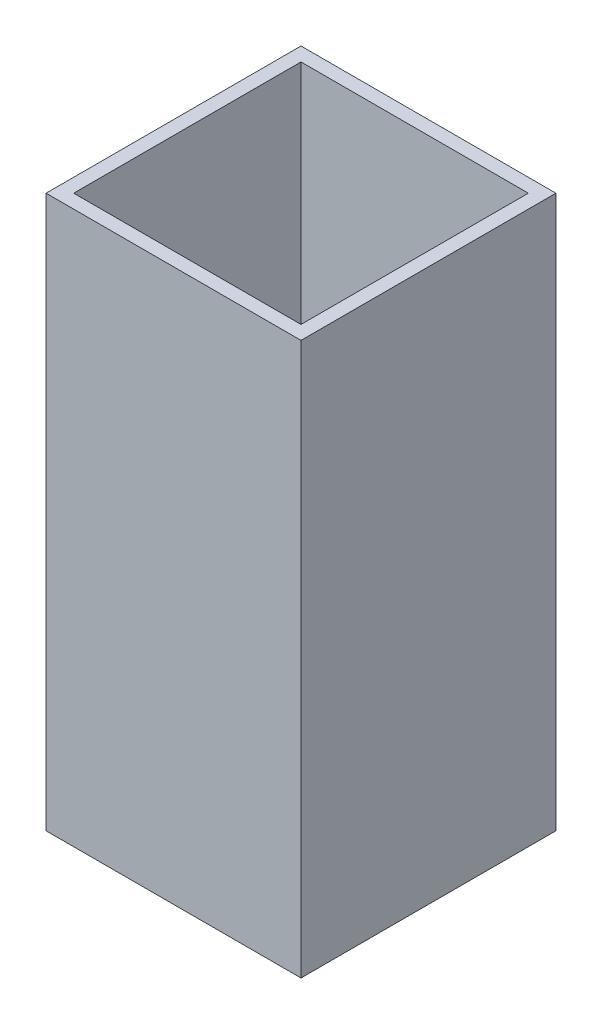
ISO-10303-21;
HEADER;
FILE_DESCRIPTION(('STEP AP214'),'2;1');
FILE_NAME('part.step','',(''),(''),'','','');
FILE_SCHEMA(('AUTOMOTIVE_DESIGN { 1 0 10303 214 1 1 1 1 }'));
ENDSEC;
DATA;
#1=APPLICATION_CONTEXT('core data for automotive mechanical design processes');
#2=APPLICATION_PROTOCOL_DEFINITION('international standard','automotive_design',2000,#1);
#3=PRODUCT_CONTEXT('',#1,'mechanical');
#4=PRODUCT('Part','Part','',(#3));
#5=PRODUCT_RELATED_PRODUCT_CATEGORY('part','',(#4));
#6=PRODUCT_DEFINITION_FORMATION('','',#4);
#7=PRODUCT_DEFINITION_CONTEXT('part definition',#1,'design');
#8=PRODUCT_DEFINITION('design','',#6,#7);
#9=PRODUCT_DEFINITION_SHAPE('','',#8);
#10=(LENGTH_UNIT() NAMED_UNIT(*) SI_UNIT(.MILLI.,.METRE.));
#11=(NAMED_UNIT(*) PLANE_ANGLE_UNIT() SI_UNIT($,.RADIAN.));
#12=(NAMED_UNIT(*) SI_UNIT($,.STERADIAN.) SOLID_ANGLE_UNIT());
#13=UNCERTAINTY_MEASURE_WITH_UNIT(LENGTH_MEASURE(1.E-05),#10,'distance_accuracy_value','');
#14=(GEOMETRIC_REPRESENTATION_CONTEXT(3) GLOBAL_UNCERTAINTY_ASSIGNED_CONTEXT((#13)) GLOBAL_UNIT_ASSIGNED_CONTEXT((#10,
#11,#12)) REPRESENTATION_CONTEXT('',''));
#15=CARTESIAN_POINT('',(0.,0.,0.));
#16=DIRECTION('',(0.,0.,1.));
#17=DIRECTION('',(1.,0.,0.));
#18=AXIS2_PLACEMENT_3D('',#15,#16,#17);
#19=CARTESIAN_POINT('',(1.235,-4.,-1.235));
#20=DIRECTION('',(1.,0.,0.));
#21=DIRECTION('',(0.,0.,-1.));
#22=AXIS2_PLACEMENT_3D('',#19,#20,#21);
#23=PLANE('',#22);
#24=DIRECTION('',(0.,0.,1.));
#25=VECTOR('',#24,1.);
#26=CARTESIAN_POINT('',(1.235,6.,1.385));
#27=LINE('',#26,#25);
#28=CARTESIAN_POINT('',(1.235,6.,-1.235));
#29=VERTEX_POINT('',#28);
#30=CARTESIAN_POINT('',(1.235,6.,1.235));
#31=VERTEX_POINT('',#30);
#32=EDGE_CURVE('E107',#29,#31,#27,.T.);
#33=ORIENTED_EDGE('',*,*,#32,.F.);
#34=DIRECTION('',(0.,1.,0.));
#35=VECTOR('',#34,1.);
#36=CARTESIAN_POINT('',(1.235,-4.,-1.235));
#37=LINE('',#36,#35);
#38=CARTESIAN_POINT('',(1.235,0.,-1.235));
#39=VERTEX_POINT('',#38);
#40=EDGE_CURVE('E103',#29,#39,#37,.F.);
#41=ORIENTED_EDGE('',*,*,#40,.T.);
#42=DIRECTION('',(0.,0.,1.));
#43=VECTOR('',#42,1.);
#44=CARTESIAN_POINT('',(1.235,0.,1.385));
#45=LINE('',#44,#43);
#46=CARTESIAN_POINT('',(1.235,0.,1.235));
#47=VERTEX_POINT('',#46);
#48=EDGE_CURVE('E117',#39,#47,#45,.T.);
#49=ORIENTED_EDGE('',*,*,#48,.T.);
#50=DIRECTION('',(0.,1.,0.));
#51=VECTOR('',#50,1.);
#52=CARTESIAN_POINT('',(1.235,-4.,1.235));
#53=LINE('',#52,#51);
#54=EDGE_CURVE('E20',#47,#31,#53,.T.);
#55=ORIENTED_EDGE('',*,*,#54,.T.);
#56=EDGE_LOOP('',(#33,#41,#49,#55));
#57=FACE_BOUND('',#56,.T.);
#58=ADVANCED_FACE('F17',(#57),#23,.F.);
#59=CARTESIAN_POINT('',(-1.235,-4.,1.235));
#60=DIRECTION('',(0.,0.,1.));
#61=DIRECTION('',(1.,0.,0.));
#62=AXIS2_PLACEMENT_3D('',#59,#60,#61);
#63=PLANE('',#62);
#64=DIRECTION('',(1.,0.,0.));
#65=VECTOR('',#64,1.);
#66=CARTESIAN_POINT('',(1.385,6.,1.235));
#67=LINE('',#66,#65);
#68=CARTESIAN_POINT('',(-1.235,6.,1.235));
#69=VERTEX_POINT('',#68);
#70=EDGE_CURVE('E91',#31,#69,#67,.F.);
#71=ORIENTED_EDGE('',*,*,#70,.F.);
#72=ORIENTED_EDGE('',*,*,#54,.F.);
#73=DIRECTION('',(1.,0.,0.));
#74=VECTOR('',#73,1.);
#75=CARTESIAN_POINT('',(1.385,0.,1.235));
#76=LINE('',#75,#74);
#77=CARTESIAN_POINT('',(-1.235,0.,1.235));
#78=VERTEX_POINT('',#77);
#79=EDGE_CURVE('E131',#47,#78,#76,.F.);
#80=ORIENTED_EDGE('',*,*,#79,.T.);
#81=DIRECTION('',(0.,1.,0.));
#82=VECTOR('',#81,1.);
#83=CARTESIAN_POINT('',(-1.235,-4.,1.235));
#84=LINE('',#83,#82);
#85=EDGE_CURVE('E79',#78,#69,#84,.T.);
#86=ORIENTED_EDGE('',*,*,#85,.T.);
#87=EDGE_LOOP('',(#71,#72,#80,#86));
#88=FACE_BOUND('',#87,.T.);
#89=ADVANCED_FACE('F119',(#88),#63,.F.);
#90=CARTESIAN_POINT('',(-1.235,-4.,-1.235));
#91=DIRECTION('',(-1.,0.,0.));
#92=DIRECTION('',(0.,0.,1.));
#93=AXIS2_PLACEMENT_3D('',#90,#91,#92);
#94=PLANE('',#93);
#95=DIRECTION('',(0.,0.,1.));
#96=VECTOR('',#95,1.);
#97=CARTESIAN_POINT('',(-1.235,6.,1.385));
#98=LINE('',#97,#96);
#99=CARTESIAN_POINT('',(-1.235,6.,-1.235));
#100=VERTEX_POINT('',#99);
#101=EDGE_CURVE('E85',#69,#100,#98,.F.);
#102=ORIENTED_EDGE('',*,*,#101,.F.);
#103=ORIENTED_EDGE('',*,*,#85,.F.);
#104=DIRECTION('',(0.,0.,1.));
#105=VECTOR('',#104,1.);
#106=CARTESIAN_POINT('',(-1.235,0.,1.385));
#107=LINE('',#106,#105);
#108=CARTESIAN_POINT('',(-1.235,0.,-1.235));
#109=VERTEX_POINT('',#108);
#110=EDGE_CURVE('E99',#78,#109,#107,.F.);
#111=ORIENTED_EDGE('',*,*,#110,.T.);
#112=DIRECTION('',(0.,1.,0.));
#113=VECTOR('',#112,1.);
#114=CARTESIAN_POINT('',(-1.235,-4.,-1.235));
#115=LINE('',#114,#113);
#116=EDGE_CURVE('E96',#109,#100,#115,.T.);
#117=ORIENTED_EDGE('',*,*,#116,.T.);
#118=EDGE_LOOP('',(#102,#103,#111,#117));
#119=FACE_BOUND('',#118,.T.);
#120=ADVANCED_FACE('F97',(#119),#94,.F.);
#121=CARTESIAN_POINT('',(-1.235,-4.,-1.235));
#122=DIRECTION('',(0.,0.,-1.));
#123=DIRECTION('',(-1.,0.,0.));
#124=AXIS2_PLACEMENT_3D('',#121,#122,#123);
#125=PLANE('',#124);
#126=DIRECTION('',(1.,0.,0.));
#127=VECTOR('',#126,1.);
#128=CARTESIAN_POINT('',(1.385,6.,-1.235));
#129=LINE('',#128,#127);
#130=EDGE_CURVE('E89',#100,#29,#129,.T.);
#131=ORIENTED_EDGE('',*,*,#130,.F.);
#132=ORIENTED_EDGE('',*,*,#116,.F.);
#133=DIRECTION('',(1.,0.,0.));
#134=VECTOR('',#133,1.);
#135=CARTESIAN_POINT('',(1.385,0.,-1.235));
#136=LINE('',#135,#134);
#137=EDGE_CURVE('E134',#109,#39,#136,.T.);
#138=ORIENTED_EDGE('',*,*,#137,.T.);
#139=ORIENTED_EDGE('',*,*,#40,.F.);
#140=EDGE_LOOP('',(#131,#132,#138,#139));
#141=FACE_BOUND('',#140,.T.);
#142=ADVANCED_FACE('F105',(#141),#125,.F.);
#143=CARTESIAN_POINT('',(-1.385,6.,-1.385));
#144=DIRECTION('',(1.,0.,0.));
#145=DIRECTION('',(0.,0.,-1.));
#146=AXIS2_PLACEMENT_3D('',#143,#144,#145);
#147=PLANE('',#146);
#148=DIRECTION('',(0.,1.,0.));
#149=VECTOR('',#148,1.);
#150=CARTESIAN_POINT('',(-1.385,6.,1.385));
#151=LINE('',#150,#149);
#152=CARTESIAN_POINT('',(-1.385,0.,1.385));
#153=VERTEX_POINT('',#152);
#154=CARTESIAN_POINT('',(-1.385,6.,1.385));
#155=VERTEX_POINT('',#154);
#156=EDGE_CURVE('E93',#153,#155,#151,.T.);
#157=ORIENTED_EDGE('',*,*,#156,.T.);
#158=DIRECTION('',(0.,0.,1.));
#159=VECTOR('',#158,1.);
#160=CARTESIAN_POINT('',(-1.385,6.,1.385));
#161=LINE('',#160,#159);
#162=CARTESIAN_POINT('',(-1.385,6.,-1.385));
#163=VERTEX_POINT('',#162);
#164=EDGE_CURVE('E120',#163,#155,#161,.T.);
#165=ORIENTED_EDGE('',*,*,#164,.F.);
#166=DIRECTION('',(0.,1.,0.));
#167=VECTOR('',#166,1.);
#168=CARTESIAN_POINT('',(-1.385,6.,-1.385));
#169=LINE('',#168,#167);
#170=CARTESIAN_POINT('',(-1.385,0.,-1.385));
#171=VERTEX_POINT('',#170);
#172=EDGE_CURVE('E128',#163,#171,#169,.F.);
#173=ORIENTED_EDGE('',*,*,#172,.T.);
#174=DIRECTION('',(0.,0.,1.));
#175=VECTOR('',#174,1.);
#176=CARTESIAN_POINT('',(-1.385,0.,1.385));
#177=LINE('',#176,#175);
#178=EDGE_CURVE('E137',#171,#153,#177,.T.);
#179=ORIENTED_EDGE('',*,*,#178,.T.);
#180=EDGE_LOOP('',(#157,#165,#173,#179));
#181=FACE_BOUND('',#180,.T.);
#182=ADVANCED_FACE('F178',(#181),#147,.F.);
#183=CARTESIAN_POINT('',(-1.385,6.,1.385));
#184=DIRECTION('',(0.,0.,-1.));
#185=DIRECTION('',(-1.,0.,0.));
#186=AXIS2_PLACEMENT_3D('',#183,#184,#185);
#187=PLANE('',#186);
#188=DIRECTION('',(0.,1.,0.));
#189=VECTOR('',#188,1.);
#190=CARTESIAN_POINT('',(1.385,6.,1.385));
#191=LINE('',#190,#189);
#192=CARTESIAN_POINT('',(1.385,0.,1.385));
#193=VERTEX_POINT('',#192);
#194=CARTESIAN_POINT('',(1.385,6.,1.385));
#195=VERTEX_POINT('',#194);
#196=EDGE_CURVE('E143',#193,#195,#191,.T.);
#197=ORIENTED_EDGE('',*,*,#196,.T.);
#198=DIRECTION('',(1.,0.,0.));
#199=VECTOR('',#198,1.);
#200=CARTESIAN_POINT('',(1.385,6.,1.385));
#201=LINE('',#200,#199);
#202=EDGE_CURVE('E121',#155,#195,#201,.T.);
#203=ORIENTED_EDGE('',*,*,#202,.F.);
#204=ORIENTED_EDGE('',*,*,#156,.F.);
#205=DIRECTION('',(1.,0.,0.));
#206=VECTOR('',#205,1.);
#207=CARTESIAN_POINT('',(1.385,0.,1.385));
#208=LINE('',#207,#206);
#209=EDGE_CURVE('E140',#153,#193,#208,.T.);
#210=ORIENTED_EDGE('',*,*,#209,.T.);
#211=EDGE_LOOP('',(#197,#203,#204,#210));
#212=FACE_BOUND('',#211,.T.);
#213=ADVANCED_FACE('F160',(#212),#187,.F.);
#214=CARTESIAN_POINT('',(1.385,6.,1.385));
#215=DIRECTION('',(0.,1.,0.));
#216=DIRECTION('',(0.,0.,1.));
#217=AXIS2_PLACEMENT_3D('',#214,#215,#216);
#218=PLANE('',#217);
#219=ORIENTED_EDGE('',*,*,#164,.T.);
#220=ORIENTED_EDGE('',*,*,#202,.T.);
#221=DIRECTION('',(0.,0.,1.));
#222=VECTOR('',#221,1.);
#223=CARTESIAN_POINT('',(1.385,6.,-1.385));
#224=LINE('',#223,#222);
#225=CARTESIAN_POINT('',(1.385,6.,-1.385));
#226=VERTEX_POINT('',#225);
#227=EDGE_CURVE('E146',#195,#226,#224,.F.);
#228=ORIENTED_EDGE('',*,*,#227,.T.);
#229=DIRECTION('',(1.,0.,0.));
#230=VECTOR('',#229,1.);
#231=CARTESIAN_POINT('',(-1.385,6.,-1.385));
#232=LINE('',#231,#230);
#233=EDGE_CURVE('E125',#226,#163,#232,.F.);
#234=ORIENTED_EDGE('',*,*,#233,.T.);
#235=EDGE_LOOP('',(#219,#220,#228,#234));
#236=FACE_BOUND('',#235,.T.);
#237=ORIENTED_EDGE('',*,*,#32,.T.);
#238=ORIENTED_EDGE('',*,*,#70,.T.);
#239=ORIENTED_EDGE('',*,*,#101,.T.);
#240=ORIENTED_EDGE('',*,*,#130,.T.);
#241=EDGE_LOOP('',(#237,#238,#239,#240));
#242=FACE_BOUND('',#241,.T.);
#243=ADVANCED_FACE('F87',(#236,#242),#218,.T.);
#244=CARTESIAN_POINT('',(-1.385,6.,-1.385));
#245=DIRECTION('',(0.,0.,1.));
#246=DIRECTION('',(1.,0.,0.));
#247=AXIS2_PLACEMENT_3D('',#244,#245,#246);
#248=PLANE('',#247);
#249=ORIENTED_EDGE('',*,*,#172,.F.);
#250=ORIENTED_EDGE('',*,*,#233,.F.);
#251=DIRECTION('',(0.,1.,0.));
#252=VECTOR('',#251,1.);
#253=CARTESIAN_POINT('',(1.385,6.,-1.385));
#254=LINE('',#253,#252);
#255=CARTESIAN_POINT('',(1.385,0.,-1.385));
#256=VERTEX_POINT('',#255);
#257=EDGE_CURVE('E26',#226,#256,#254,.F.);
#258=ORIENTED_EDGE('',*,*,#257,.T.);
#259=DIRECTION('',(1.,0.,0.));
#260=VECTOR('',#259,1.);
#261=CARTESIAN_POINT('',(1.385,0.,-1.385));
#262=LINE('',#261,#260);
#263=EDGE_CURVE('E34',#256,#171,#262,.F.);
#264=ORIENTED_EDGE('',*,*,#263,.T.);
#265=EDGE_LOOP('',(#249,#250,#258,#264));
#266=FACE_BOUND('',#265,.T.);
#267=ADVANCED_FACE('F153',(#266),#248,.F.);
#268=CARTESIAN_POINT('',(1.385,0.,1.385));
#269=DIRECTION('',(0.,1.,0.));
#270=DIRECTION('',(0.,0.,1.));
#271=AXIS2_PLACEMENT_3D('',#268,#269,#270);
#272=PLANE('',#271);
#273=ORIENTED_EDGE('',*,*,#209,.F.);
#274=ORIENTED_EDGE('',*,*,#178,.F.);
#275=ORIENTED_EDGE('',*,*,#263,.F.);
#276=DIRECTION('',(0.,0.,1.));
#277=VECTOR('',#276,1.);
#278=CARTESIAN_POINT('',(1.385,0.,-1.385));
#279=LINE('',#278,#277);
#280=EDGE_CURVE('E11',#256,#193,#279,.T.);
#281=ORIENTED_EDGE('',*,*,#280,.T.);
#282=EDGE_LOOP('',(#273,#274,#275,#281));
#283=FACE_BOUND('',#282,.T.);
#284=ORIENTED_EDGE('',*,*,#110,.F.);
#285=ORIENTED_EDGE('',*,*,#79,.F.);
#286=ORIENTED_EDGE('',*,*,#48,.F.);
#287=ORIENTED_EDGE('',*,*,#137,.F.);
#288=EDGE_LOOP('',(#284,#285,#286,#287));
#289=FACE_BOUND('',#288,.T.);
#290=ADVANCED_FACE('F162',(#283,#289),#272,.F.);
#291=CARTESIAN_POINT('',(1.385,6.,-1.385));
#292=DIRECTION('',(-1.,0.,0.));
#293=DIRECTION('',(0.,0.,1.));
#294=AXIS2_PLACEMENT_3D('',#291,#292,#293);
#295=PLANE('',#294);
#296=ORIENTED_EDGE('',*,*,#257,.F.);
#297=ORIENTED_EDGE('',*,*,#227,.F.);
#298=ORIENTED_EDGE('',*,*,#196,.F.);
#299=ORIENTED_EDGE('',*,*,#280,.F.);
#300=EDGE_LOOP('',(#296,#297,#298,#299));
#301=FACE_BOUND('',#300,.T.);
#302=ADVANCED_FACE('F156',(#301),#295,.F.);
#303=CLOSED_SHELL('',(#58,#89,#120,#142,#182,#213,#243,#267,#290,#302));
#304=MANIFOLD_SOLID_BREP('B1',#303);
#305=ADVANCED_BREP_SHAPE_REPRESENTATION('',(#18,#304),#14);
#306=SHAPE_DEFINITION_REPRESENTATION(#9,#305);
ENDSEC;
END-ISO-10303-21;
